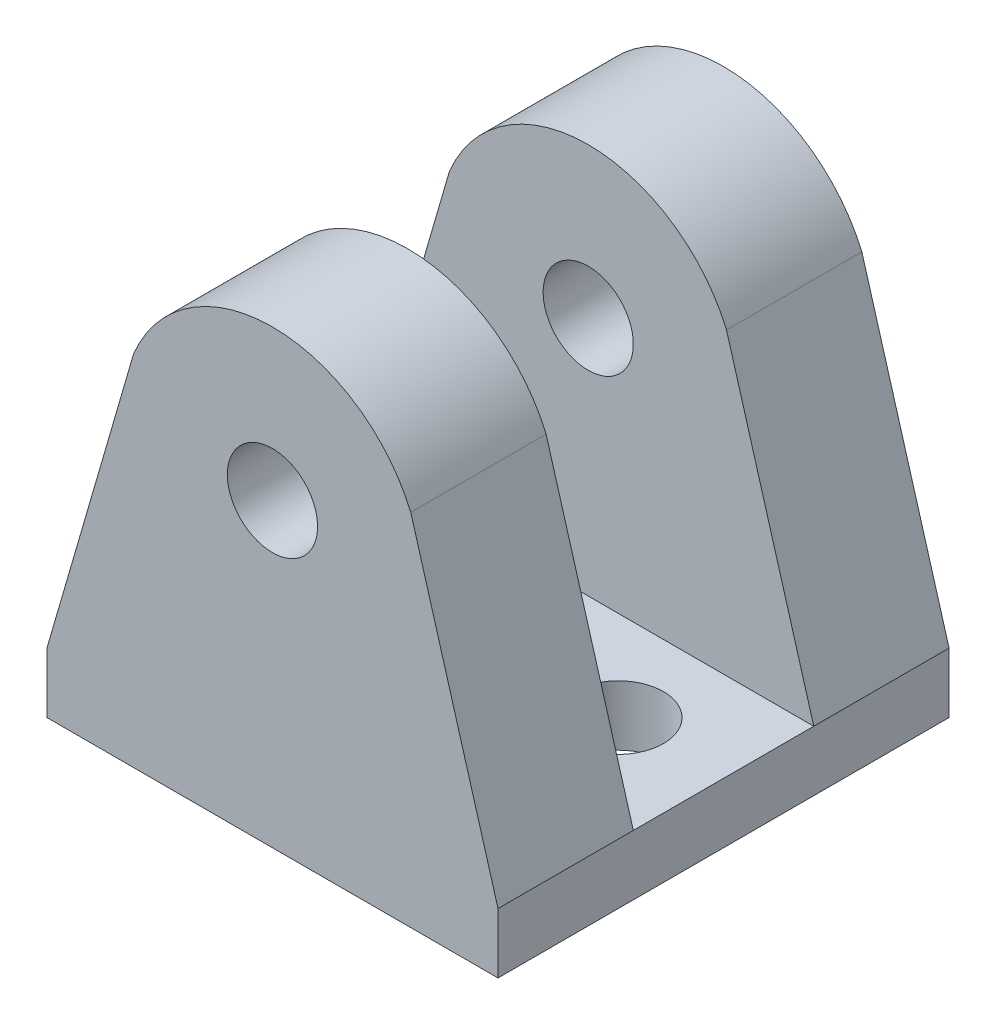
ISO-10303-21;
HEADER;
FILE_DESCRIPTION(('STEP AP214'),'2;1');
FILE_NAME('part.step','',(''),(''),'','','');
FILE_SCHEMA(('AUTOMOTIVE_DESIGN { 1 0 10303 214 1 1 1 1 }'));
ENDSEC;
DATA;
#1=APPLICATION_CONTEXT('core data for automotive mechanical design processes');
#2=APPLICATION_PROTOCOL_DEFINITION('international standard','automotive_design',2000,#1);
#3=PRODUCT_CONTEXT('',#1,'mechanical');
#4=PRODUCT('Part','Part','',(#3));
#5=PRODUCT_RELATED_PRODUCT_CATEGORY('part','',(#4));
#6=PRODUCT_DEFINITION_FORMATION('','',#4);
#7=PRODUCT_DEFINITION_CONTEXT('part definition',#1,'design');
#8=PRODUCT_DEFINITION('design','',#6,#7);
#9=PRODUCT_DEFINITION_SHAPE('','',#8);
#10=(LENGTH_UNIT() NAMED_UNIT(*) SI_UNIT(.MILLI.,.METRE.));
#11=(NAMED_UNIT(*) PLANE_ANGLE_UNIT() SI_UNIT($,.RADIAN.));
#12=(NAMED_UNIT(*) SI_UNIT($,.STERADIAN.) SOLID_ANGLE_UNIT());
#13=UNCERTAINTY_MEASURE_WITH_UNIT(LENGTH_MEASURE(1.E-05),#10,'distance_accuracy_value','');
#14=(GEOMETRIC_REPRESENTATION_CONTEXT(3) GLOBAL_UNCERTAINTY_ASSIGNED_CONTEXT((#13)) GLOBAL_UNIT_ASSIGNED_CONTEXT((#10,
#11,#12)) REPRESENTATION_CONTEXT('',''));
#15=CARTESIAN_POINT('',(0.,0.,0.));
#16=DIRECTION('',(0.,0.,1.));
#17=DIRECTION('',(1.,0.,0.));
#18=AXIS2_PLACEMENT_3D('',#15,#16,#17);
#19=CARTESIAN_POINT('',(7.5,2.,0.));
#20=DIRECTION('',(-1.,0.,0.));
#21=DIRECTION('',(0.,0.,1.));
#22=AXIS2_PLACEMENT_3D('',#19,#20,#21);
#23=PLANE('',#22);
#24=DIRECTION('',(0.,0.,-1.));
#25=VECTOR('',#24,1.);
#26=CARTESIAN_POINT('',(7.5,0.,0.));
#27=LINE('',#26,#25);
#28=CARTESIAN_POINT('',(7.5,0.,15.));
#29=VERTEX_POINT('',#28);
#30=CARTESIAN_POINT('',(7.5,0.,0.));
#31=VERTEX_POINT('',#30);
#32=EDGE_CURVE('E189',#29,#31,#27,.T.);
#33=ORIENTED_EDGE('',*,*,#32,.T.);
#34=DIRECTION('',(0.,-1.,0.));
#35=VECTOR('',#34,1.);
#36=CARTESIAN_POINT('',(7.5,2.,0.));
#37=LINE('',#36,#35);
#38=CARTESIAN_POINT('',(7.5,2.,0.));
#39=VERTEX_POINT('',#38);
#40=EDGE_CURVE('E11',#39,#31,#37,.T.);
#41=ORIENTED_EDGE('',*,*,#40,.F.);
#42=DIRECTION('',(0.,0.,-1.));
#43=VECTOR('',#42,1.);
#44=CARTESIAN_POINT('',(7.5,2.,4.5));
#45=LINE('',#44,#43);
#46=CARTESIAN_POINT('',(7.5,2.,4.5));
#47=VERTEX_POINT('',#46);
#48=EDGE_CURVE('E190',#47,#39,#45,.T.);
#49=ORIENTED_EDGE('',*,*,#48,.F.);
#50=DIRECTION('',(0.,0.,-1.));
#51=VECTOR('',#50,1.);
#52=CARTESIAN_POINT('',(7.5,2.,0.));
#53=LINE('',#52,#51);
#54=CARTESIAN_POINT('',(7.5,2.,10.5));
#55=VERTEX_POINT('',#54);
#56=EDGE_CURVE('E197',#55,#47,#53,.T.);
#57=ORIENTED_EDGE('',*,*,#56,.F.);
#58=CARTESIAN_POINT('',(7.5,2.,15.));
#59=VERTEX_POINT('',#58);
#60=EDGE_CURVE('E193',#59,#55,#53,.T.);
#61=ORIENTED_EDGE('',*,*,#60,.F.);
#62=DIRECTION('',(0.,-1.,0.));
#63=VECTOR('',#62,1.);
#64=CARTESIAN_POINT('',(7.5,2.,15.));
#65=LINE('',#64,#63);
#66=EDGE_CURVE('E155',#59,#29,#65,.T.);
#67=ORIENTED_EDGE('',*,*,#66,.T.);
#68=EDGE_LOOP('',(#33,#41,#49,#57,#61,#67));
#69=FACE_BOUND('',#68,.T.);
#70=ADVANCED_FACE('F33',(#69),#23,.F.);
#71=CARTESIAN_POINT('',(-7.5,2.,0.));
#72=DIRECTION('',(0.,0.,1.));
#73=DIRECTION('',(1.,0.,0.));
#74=AXIS2_PLACEMENT_3D('',#71,#72,#73);
#75=PLANE('',#74);
#76=DIRECTION('',(-1.,0.,0.));
#77=VECTOR('',#76,1.);
#78=CARTESIAN_POINT('',(-7.5,0.,0.));
#79=LINE('',#78,#77);
#80=CARTESIAN_POINT('',(-7.5,0.,0.));
#81=VERTEX_POINT('',#80);
#82=EDGE_CURVE('E54',#31,#81,#79,.T.);
#83=ORIENTED_EDGE('',*,*,#82,.T.);
#84=DIRECTION('',(0.,-1.,0.));
#85=VECTOR('',#84,1.);
#86=CARTESIAN_POINT('',(-7.5,2.,0.));
#87=LINE('',#86,#85);
#88=CARTESIAN_POINT('',(-7.5,2.,0.));
#89=VERTEX_POINT('',#88);
#90=EDGE_CURVE('E40',#89,#81,#87,.T.);
#91=ORIENTED_EDGE('',*,*,#90,.F.);
#92=DIRECTION('',(0.27915208066307,0.960246903593799,0.));
#93=VECTOR('',#92,1.);
#94=CARTESIAN_POINT('',(-4.61502456902073,11.9239408066089,0.));
#95=LINE('',#94,#93);
#96=CARTESIAN_POINT('',(-4.61502456902073,11.9239408066089,0.));
#97=VERTEX_POINT('',#96);
#98=EDGE_CURVE('E172',#89,#97,#95,.T.);
#99=ORIENTED_EDGE('',*,*,#98,.T.);
#100=CARTESIAN_POINT('',(0.,10.,0.));
#101=DIRECTION('',(0.,0.,-1.));
#102=DIRECTION('',(1.,0.,0.));
#103=AXIS2_PLACEMENT_3D('',#100,#101,#102);
#104=CIRCLE('',#103,5.);
#105=CARTESIAN_POINT('',(4.59899134466263,11.9619578516671,0.));
#106=VERTEX_POINT('',#105);
#107=EDGE_CURVE('E165',#97,#106,#104,.T.);
#108=ORIENTED_EDGE('',*,*,#107,.T.);
#109=DIRECTION('',(0.279594733162533,-0.960118110019685,0.));
#110=VECTOR('',#109,1.);
#111=CARTESIAN_POINT('',(4.59899134466263,11.9619578516671,0.));
#112=LINE('',#111,#110);
#113=EDGE_CURVE('E182',#106,#39,#112,.T.);
#114=ORIENTED_EDGE('',*,*,#113,.T.);
#115=ORIENTED_EDGE('',*,*,#40,.T.);
#116=EDGE_LOOP('',(#83,#91,#99,#108,#114,#115));
#117=FACE_BOUND('',#116,.T.);
#118=CARTESIAN_POINT('',(0.,10.,0.));
#119=DIRECTION('',(0.,0.,-1.));
#120=DIRECTION('',(-1.,0.,0.));
#121=AXIS2_PLACEMENT_3D('',#118,#119,#120);
#122=CIRCLE('',#121,1.5);
#123=CARTESIAN_POINT('',(-1.5,10.,0.));
#124=VERTEX_POINT('',#123);
#125=EDGE_CURVE('E161',#124,#124,#122,.T.);
#126=ORIENTED_EDGE('',*,*,#125,.F.);
#127=EDGE_LOOP('',(#126));
#128=FACE_BOUND('',#127,.T.);
#129=ADVANCED_FACE('F230',(#117,#128),#75,.F.);
#130=CARTESIAN_POINT('',(-7.5,2.,7.5));
#131=DIRECTION('',(1.,0.,0.));
#132=DIRECTION('',(0.,0.,-1.));
#133=AXIS2_PLACEMENT_3D('',#130,#131,#132);
#134=PLANE('',#133);
#135=DIRECTION('',(0.,0.,1.));
#136=VECTOR('',#135,1.);
#137=CARTESIAN_POINT('',(-7.5,0.,7.5));
#138=LINE('',#137,#136);
#139=CARTESIAN_POINT('',(-7.5,0.,15.));
#140=VERTEX_POINT('',#139);
#141=EDGE_CURVE('E203',#81,#140,#138,.T.);
#142=ORIENTED_EDGE('',*,*,#141,.T.);
#143=DIRECTION('',(0.,-1.,0.));
#144=VECTOR('',#143,1.);
#145=CARTESIAN_POINT('',(-7.5,2.,15.));
#146=LINE('',#145,#144);
#147=CARTESIAN_POINT('',(-7.5,2.,15.));
#148=VERTEX_POINT('',#147);
#149=EDGE_CURVE('E158',#148,#140,#146,.T.);
#150=ORIENTED_EDGE('',*,*,#149,.F.);
#151=DIRECTION('',(0.,0.,1.));
#152=VECTOR('',#151,1.);
#153=CARTESIAN_POINT('',(-7.5,2.,10.5));
#154=LINE('',#153,#152);
#155=CARTESIAN_POINT('',(-7.5,2.,10.5));
#156=VERTEX_POINT('',#155);
#157=EDGE_CURVE('E131',#156,#148,#154,.T.);
#158=ORIENTED_EDGE('',*,*,#157,.F.);
#159=DIRECTION('',(0.,0.,1.));
#160=VECTOR('',#159,1.);
#161=CARTESIAN_POINT('',(-7.5,2.,7.5));
#162=LINE('',#161,#160);
#163=CARTESIAN_POINT('',(-7.5,2.,4.5));
#164=VERTEX_POINT('',#163);
#165=EDGE_CURVE('E196',#164,#156,#162,.T.);
#166=ORIENTED_EDGE('',*,*,#165,.F.);
#167=EDGE_CURVE('E198',#89,#164,#162,.T.);
#168=ORIENTED_EDGE('',*,*,#167,.F.);
#169=ORIENTED_EDGE('',*,*,#90,.T.);
#170=EDGE_LOOP('',(#142,#150,#158,#166,#168,#169));
#171=FACE_BOUND('',#170,.T.);
#172=ADVANCED_FACE('F207',(#171),#134,.F.);
#173=CARTESIAN_POINT('',(0.,2.,0.));
#174=DIRECTION('',(0.,-1.,0.));
#175=DIRECTION('',(0.,0.,-1.));
#176=AXIS2_PLACEMENT_3D('',#173,#174,#175);
#177=PLANE('',#176);
#178=CARTESIAN_POINT('',(-4.,2.,7.5));
#179=DIRECTION('',(0.,-1.,0.));
#180=DIRECTION('',(0.,0.,1.));
#181=AXIS2_PLACEMENT_3D('',#178,#179,#180);
#182=CIRCLE('',#181,1.5);
#183=CARTESIAN_POINT('',(-4.,2.,9.));
#184=VERTEX_POINT('',#183);
#185=EDGE_CURVE('E265',#184,#184,#182,.T.);
#186=ORIENTED_EDGE('',*,*,#185,.T.);
#187=EDGE_LOOP('',(#186));
#188=FACE_BOUND('',#187,.T.);
#189=CARTESIAN_POINT('',(4.,2.,7.5));
#190=DIRECTION('',(0.,1.,0.));
#191=DIRECTION('',(0.,0.,1.));
#192=AXIS2_PLACEMENT_3D('',#189,#190,#191);
#193=CIRCLE('',#192,1.5);
#194=CARTESIAN_POINT('',(4.,2.,9.));
#195=VERTEX_POINT('',#194);
#196=EDGE_CURVE('E268',#195,#195,#193,.T.);
#197=ORIENTED_EDGE('',*,*,#196,.F.);
#198=EDGE_LOOP('',(#197));
#199=FACE_BOUND('',#198,.T.);
#200=ORIENTED_EDGE('',*,*,#165,.T.);
#201=DIRECTION('',(-1.,0.,0.));
#202=VECTOR('',#201,1.);
#203=CARTESIAN_POINT('',(7.5,2.,10.5));
#204=LINE('',#203,#202);
#205=EDGE_CURVE('E119',#55,#156,#204,.T.);
#206=ORIENTED_EDGE('',*,*,#205,.F.);
#207=ORIENTED_EDGE('',*,*,#56,.T.);
#208=DIRECTION('',(-1.,0.,0.));
#209=VECTOR('',#208,1.);
#210=CARTESIAN_POINT('',(7.5,2.,4.5));
#211=LINE('',#210,#209);
#212=EDGE_CURVE('E175',#47,#164,#211,.T.);
#213=ORIENTED_EDGE('',*,*,#212,.T.);
#214=EDGE_LOOP('',(#200,#206,#207,#213));
#215=FACE_BOUND('',#214,.T.);
#216=ADVANCED_FACE('F219',(#188,#199,#215),#177,.F.);
#217=CARTESIAN_POINT('',(0.,0.,0.));
#218=DIRECTION('',(0.,-1.,0.));
#219=DIRECTION('',(0.,0.,-1.));
#220=AXIS2_PLACEMENT_3D('',#217,#218,#219);
#221=PLANE('',#220);
#222=CARTESIAN_POINT('',(-4.,0.,7.5));
#223=DIRECTION('',(0.,-1.,0.));
#224=DIRECTION('',(0.,0.,1.));
#225=AXIS2_PLACEMENT_3D('',#222,#223,#224);
#226=CIRCLE('',#225,1.5);
#227=CARTESIAN_POINT('',(-4.,0.,9.));
#228=VERTEX_POINT('',#227);
#229=EDGE_CURVE('E271',#228,#228,#226,.T.);
#230=ORIENTED_EDGE('',*,*,#229,.F.);
#231=EDGE_LOOP('',(#230));
#232=FACE_BOUND('',#231,.T.);
#233=CARTESIAN_POINT('',(4.,0.,7.5));
#234=DIRECTION('',(0.,1.,0.));
#235=DIRECTION('',(0.,0.,1.));
#236=AXIS2_PLACEMENT_3D('',#233,#234,#235);
#237=CIRCLE('',#236,1.5);
#238=CARTESIAN_POINT('',(4.,0.,9.));
#239=VERTEX_POINT('',#238);
#240=EDGE_CURVE('E270',#239,#239,#237,.T.);
#241=ORIENTED_EDGE('',*,*,#240,.T.);
#242=EDGE_LOOP('',(#241));
#243=FACE_BOUND('',#242,.T.);
#244=ORIENTED_EDGE('',*,*,#32,.F.);
#245=DIRECTION('',(-1.,0.,0.));
#246=VECTOR('',#245,1.);
#247=CARTESIAN_POINT('',(-7.5,0.,15.));
#248=LINE('',#247,#246);
#249=EDGE_CURVE('E151',#29,#140,#248,.T.);
#250=ORIENTED_EDGE('',*,*,#249,.T.);
#251=ORIENTED_EDGE('',*,*,#141,.F.);
#252=ORIENTED_EDGE('',*,*,#82,.F.);
#253=EDGE_LOOP('',(#244,#250,#251,#252));
#254=FACE_BOUND('',#253,.T.);
#255=ADVANCED_FACE('F211',(#232,#243,#254),#221,.T.);
#256=CARTESIAN_POINT('',(0.,10.,4.5));
#257=DIRECTION('',(0.,0.,-1.));
#258=DIRECTION('',(-1.,0.,0.));
#259=AXIS2_PLACEMENT_3D('',#256,#257,#258);
#260=CYLINDRICAL_SURFACE('',#259,5.);
#261=ORIENTED_EDGE('',*,*,#107,.F.);
#262=DIRECTION('',(0.,0.,-1.));
#263=VECTOR('',#262,1.);
#264=CARTESIAN_POINT('',(-4.61502456902073,11.9239408066089,4.5));
#265=LINE('',#264,#263);
#266=CARTESIAN_POINT('',(-4.61502456902073,11.9239408066089,4.5));
#267=VERTEX_POINT('',#266);
#268=EDGE_CURVE('E187',#267,#97,#265,.T.);
#269=ORIENTED_EDGE('',*,*,#268,.F.);
#270=CARTESIAN_POINT('',(0.,10.,4.5));
#271=DIRECTION('',(0.,0.,-1.));
#272=DIRECTION('',(1.,0.,0.));
#273=AXIS2_PLACEMENT_3D('',#270,#271,#272);
#274=CIRCLE('',#273,5.);
#275=CARTESIAN_POINT('',(4.59899134466263,11.9619578516671,4.5));
#276=VERTEX_POINT('',#275);
#277=EDGE_CURVE('E168',#267,#276,#274,.T.);
#278=ORIENTED_EDGE('',*,*,#277,.T.);
#279=DIRECTION('',(0.,0.,-1.));
#280=VECTOR('',#279,1.);
#281=CARTESIAN_POINT('',(4.59899134466263,11.9619578516671,4.5));
#282=LINE('',#281,#280);
#283=EDGE_CURVE('E179',#276,#106,#282,.T.);
#284=ORIENTED_EDGE('',*,*,#283,.T.);
#285=EDGE_LOOP('',(#261,#269,#278,#284));
#286=FACE_BOUND('',#285,.T.);
#287=ADVANCED_FACE('F234',(#286),#260,.T.);
#288=CARTESIAN_POINT('',(-4.61502456902073,11.9239408066089,4.5));
#289=DIRECTION('',(-0.960246903593799,0.27915208066307,0.));
#290=DIRECTION('',(-0.27915208066307,-0.960246903593799,0.));
#291=AXIS2_PLACEMENT_3D('',#288,#289,#290);
#292=PLANE('',#291);
#293=ORIENTED_EDGE('',*,*,#98,.F.);
#294=ORIENTED_EDGE('',*,*,#167,.T.);
#295=DIRECTION('',(0.27915208066307,0.960246903593799,0.));
#296=VECTOR('',#295,1.);
#297=CARTESIAN_POINT('',(-4.61502456902073,11.9239408066089,4.5));
#298=LINE('',#297,#296);
#299=EDGE_CURVE('E47',#164,#267,#298,.T.);
#300=ORIENTED_EDGE('',*,*,#299,.T.);
#301=ORIENTED_EDGE('',*,*,#268,.T.);
#302=EDGE_LOOP('',(#293,#294,#300,#301));
#303=FACE_BOUND('',#302,.T.);
#304=ADVANCED_FACE('F236',(#303),#292,.T.);
#305=CARTESIAN_POINT('',(4.59899134466263,11.9619578516671,4.5));
#306=DIRECTION('',(0.960118110019685,0.279594733162533,0.));
#307=DIRECTION('',(-0.279594733162533,0.960118110019685,0.));
#308=AXIS2_PLACEMENT_3D('',#305,#306,#307);
#309=PLANE('',#308);
#310=ORIENTED_EDGE('',*,*,#113,.F.);
#311=ORIENTED_EDGE('',*,*,#283,.F.);
#312=DIRECTION('',(0.279594733162533,-0.960118110019685,0.));
#313=VECTOR('',#312,1.);
#314=CARTESIAN_POINT('',(4.59899134466263,11.9619578516671,4.5));
#315=LINE('',#314,#313);
#316=EDGE_CURVE('E171',#276,#47,#315,.T.);
#317=ORIENTED_EDGE('',*,*,#316,.T.);
#318=ORIENTED_EDGE('',*,*,#48,.T.);
#319=EDGE_LOOP('',(#310,#311,#317,#318));
#320=FACE_BOUND('',#319,.T.);
#321=ADVANCED_FACE('F226',(#320),#309,.T.);
#322=CARTESIAN_POINT('',(0.,10.,4.5));
#323=DIRECTION('',(0.,0.,1.));
#324=DIRECTION('',(1.,0.,0.));
#325=AXIS2_PLACEMENT_3D('',#322,#323,#324);
#326=PLANE('',#325);
#327=CARTESIAN_POINT('',(0.,10.,4.5));
#328=DIRECTION('',(0.,0.,-1.));
#329=DIRECTION('',(-1.,0.,0.));
#330=AXIS2_PLACEMENT_3D('',#327,#328,#329);
#331=CIRCLE('',#330,1.5);
#332=CARTESIAN_POINT('',(-1.5,10.,4.5));
#333=VERTEX_POINT('',#332);
#334=EDGE_CURVE('E162',#333,#333,#331,.T.);
#335=ORIENTED_EDGE('',*,*,#334,.T.);
#336=EDGE_LOOP('',(#335));
#337=FACE_BOUND('',#336,.T.);
#338=ORIENTED_EDGE('',*,*,#277,.F.);
#339=ORIENTED_EDGE('',*,*,#299,.F.);
#340=ORIENTED_EDGE('',*,*,#212,.F.);
#341=ORIENTED_EDGE('',*,*,#316,.F.);
#342=EDGE_LOOP('',(#338,#339,#340,#341));
#343=FACE_BOUND('',#342,.T.);
#344=ADVANCED_FACE('F222',(#337,#343),#326,.T.);
#345=CARTESIAN_POINT('',(0.,10.,4.5));
#346=DIRECTION('',(0.,0.,-1.));
#347=DIRECTION('',(-1.,0.,0.));
#348=AXIS2_PLACEMENT_3D('',#345,#346,#347);
#349=CYLINDRICAL_SURFACE('',#348,1.5);
#350=ORIENTED_EDGE('',*,*,#334,.F.);
#351=EDGE_LOOP('',(#350));
#352=FACE_BOUND('',#351,.T.);
#353=ORIENTED_EDGE('',*,*,#125,.T.);
#354=EDGE_LOOP('',(#353));
#355=FACE_BOUND('',#354,.T.);
#356=ADVANCED_FACE('F308',(#352,#355),#349,.F.);
#357=CARTESIAN_POINT('',(-7.5,2.,15.));
#358=DIRECTION('',(0.,0.,1.));
#359=DIRECTION('',(1.,0.,0.));
#360=AXIS2_PLACEMENT_3D('',#357,#358,#359);
#361=PLANE('',#360);
#362=ORIENTED_EDGE('',*,*,#249,.F.);
#363=ORIENTED_EDGE('',*,*,#66,.F.);
#364=DIRECTION('',(0.279594733162533,-0.960118110019685,0.));
#365=VECTOR('',#364,1.);
#366=CARTESIAN_POINT('',(4.59899134466264,11.9619578516671,15.));
#367=LINE('',#366,#365);
#368=CARTESIAN_POINT('',(4.59899134466264,11.9619578516671,15.));
#369=VERTEX_POINT('',#368);
#370=EDGE_CURVE('E137',#369,#59,#367,.T.);
#371=ORIENTED_EDGE('',*,*,#370,.F.);
#372=CARTESIAN_POINT('',(0.,10.,15.));
#373=DIRECTION('',(0.,0.,-1.));
#374=DIRECTION('',(1.,0.,0.));
#375=AXIS2_PLACEMENT_3D('',#372,#373,#374);
#376=CIRCLE('',#375,5.);
#377=CARTESIAN_POINT('',(-4.61502456902072,11.9239408066089,15.));
#378=VERTEX_POINT('',#377);
#379=EDGE_CURVE('E146',#378,#369,#376,.T.);
#380=ORIENTED_EDGE('',*,*,#379,.F.);
#381=DIRECTION('',(0.27915208066307,0.960246903593799,0.));
#382=VECTOR('',#381,1.);
#383=CARTESIAN_POINT('',(-4.61502456902072,11.9239408066089,15.));
#384=LINE('',#383,#382);
#385=EDGE_CURVE('E127',#148,#378,#384,.T.);
#386=ORIENTED_EDGE('',*,*,#385,.F.);
#387=ORIENTED_EDGE('',*,*,#149,.T.);
#388=EDGE_LOOP('',(#362,#363,#371,#380,#386,#387));
#389=FACE_BOUND('',#388,.T.);
#390=CARTESIAN_POINT('',(0.,10.,15.));
#391=DIRECTION('',(0.,0.,-1.));
#392=DIRECTION('',(-1.,0.,0.));
#393=AXIS2_PLACEMENT_3D('',#390,#391,#392);
#394=CIRCLE('',#393,1.5);
#395=CARTESIAN_POINT('',(-1.5,10.,15.));
#396=VERTEX_POINT('',#395);
#397=EDGE_CURVE('E141',#396,#396,#394,.T.);
#398=ORIENTED_EDGE('',*,*,#397,.T.);
#399=EDGE_LOOP('',(#398));
#400=FACE_BOUND('',#399,.T.);
#401=ADVANCED_FACE('F215',(#389,#400),#361,.T.);
#402=CARTESIAN_POINT('',(0.,10.,10.5));
#403=DIRECTION('',(0.,0.,-1.));
#404=DIRECTION('',(1.,0.,0.));
#405=AXIS2_PLACEMENT_3D('',#402,#403,#404);
#406=PLANE('',#405);
#407=CARTESIAN_POINT('',(0.,10.,10.5));
#408=DIRECTION('',(0.,0.,-1.));
#409=DIRECTION('',(1.,0.,0.));
#410=AXIS2_PLACEMENT_3D('',#407,#408,#409);
#411=CIRCLE('',#410,5.);
#412=CARTESIAN_POINT('',(-4.61502456902073,11.9239408066089,10.5));
#413=VERTEX_POINT('',#412);
#414=CARTESIAN_POINT('',(4.59899134466264,11.9619578516671,10.5));
#415=VERTEX_POINT('',#414);
#416=EDGE_CURVE('E116',#413,#415,#411,.T.);
#417=ORIENTED_EDGE('',*,*,#416,.T.);
#418=DIRECTION('',(0.279594733162533,-0.960118110019685,0.));
#419=VECTOR('',#418,1.);
#420=CARTESIAN_POINT('',(4.59899134466264,11.9619578516671,10.5));
#421=LINE('',#420,#419);
#422=EDGE_CURVE('E132',#415,#55,#421,.T.);
#423=ORIENTED_EDGE('',*,*,#422,.T.);
#424=ORIENTED_EDGE('',*,*,#205,.T.);
#425=DIRECTION('',(0.27915208066307,0.960246903593799,0.));
#426=VECTOR('',#425,1.);
#427=CARTESIAN_POINT('',(-4.61502456902073,11.9239408066089,10.5));
#428=LINE('',#427,#426);
#429=EDGE_CURVE('E111',#156,#413,#428,.T.);
#430=ORIENTED_EDGE('',*,*,#429,.T.);
#431=EDGE_LOOP('',(#417,#423,#424,#430));
#432=FACE_BOUND('',#431,.T.);
#433=CARTESIAN_POINT('',(0.,10.,10.5));
#434=DIRECTION('',(0.,0.,-1.));
#435=DIRECTION('',(-1.,0.,0.));
#436=AXIS2_PLACEMENT_3D('',#433,#434,#435);
#437=CIRCLE('',#436,1.5);
#438=CARTESIAN_POINT('',(-1.5,10.,10.5));
#439=VERTEX_POINT('',#438);
#440=EDGE_CURVE('E148',#439,#439,#437,.T.);
#441=ORIENTED_EDGE('',*,*,#440,.F.);
#442=EDGE_LOOP('',(#441));
#443=FACE_BOUND('',#442,.T.);
#444=ADVANCED_FACE('F113',(#432,#443),#406,.T.);
#445=CARTESIAN_POINT('',(0.,10.,10.5));
#446=DIRECTION('',(0.,0.,1.));
#447=DIRECTION('',(1.,0.,0.));
#448=AXIS2_PLACEMENT_3D('',#445,#446,#447);
#449=CYLINDRICAL_SURFACE('',#448,5.);
#450=ORIENTED_EDGE('',*,*,#379,.T.);
#451=DIRECTION('',(0.,0.,1.));
#452=VECTOR('',#451,1.);
#453=CARTESIAN_POINT('',(4.59899134466264,11.9619578516671,10.5));
#454=LINE('',#453,#452);
#455=EDGE_CURVE('E136',#415,#369,#454,.T.);
#456=ORIENTED_EDGE('',*,*,#455,.F.);
#457=ORIENTED_EDGE('',*,*,#416,.F.);
#458=DIRECTION('',(0.,0.,1.));
#459=VECTOR('',#458,1.);
#460=CARTESIAN_POINT('',(-4.61502456902073,11.9239408066089,10.5));
#461=LINE('',#460,#459);
#462=EDGE_CURVE('E125',#413,#378,#461,.T.);
#463=ORIENTED_EDGE('',*,*,#462,.T.);
#464=EDGE_LOOP('',(#450,#456,#457,#463));
#465=FACE_BOUND('',#464,.T.);
#466=ADVANCED_FACE('F134',(#465),#449,.T.);
#467=CARTESIAN_POINT('',(4.59899134466264,11.9619578516671,10.5));
#468=DIRECTION('',(-0.960118110019685,-0.279594733162533,0.));
#469=DIRECTION('',(0.279594733162533,-0.960118110019685,0.));
#470=AXIS2_PLACEMENT_3D('',#467,#468,#469);
#471=PLANE('',#470);
#472=ORIENTED_EDGE('',*,*,#370,.T.);
#473=ORIENTED_EDGE('',*,*,#60,.T.);
#474=ORIENTED_EDGE('',*,*,#422,.F.);
#475=ORIENTED_EDGE('',*,*,#455,.T.);
#476=EDGE_LOOP('',(#472,#473,#474,#475));
#477=FACE_BOUND('',#476,.T.);
#478=ADVANCED_FACE('F295',(#477),#471,.F.);
#479=CARTESIAN_POINT('',(-4.61502456902073,11.9239408066089,10.5));
#480=DIRECTION('',(0.960246903593799,-0.27915208066307,0.));
#481=DIRECTION('',(0.27915208066307,0.960246903593799,0.));
#482=AXIS2_PLACEMENT_3D('',#479,#480,#481);
#483=PLANE('',#482);
#484=ORIENTED_EDGE('',*,*,#385,.T.);
#485=ORIENTED_EDGE('',*,*,#462,.F.);
#486=ORIENTED_EDGE('',*,*,#429,.F.);
#487=ORIENTED_EDGE('',*,*,#157,.T.);
#488=EDGE_LOOP('',(#484,#485,#486,#487));
#489=FACE_BOUND('',#488,.T.);
#490=ADVANCED_FACE('F126',(#489),#483,.F.);
#491=CARTESIAN_POINT('',(0.,10.,10.5));
#492=DIRECTION('',(0.,0.,1.));
#493=DIRECTION('',(1.,0.,0.));
#494=AXIS2_PLACEMENT_3D('',#491,#492,#493);
#495=CYLINDRICAL_SURFACE('',#494,1.5);
#496=ORIENTED_EDGE('',*,*,#440,.T.);
#497=EDGE_LOOP('',(#496));
#498=FACE_BOUND('',#497,.T.);
#499=ORIENTED_EDGE('',*,*,#397,.F.);
#500=EDGE_LOOP('',(#499));
#501=FACE_BOUND('',#500,.T.);
#502=ADVANCED_FACE('F284',(#498,#501),#495,.F.);
#503=CARTESIAN_POINT('',(4.,0.,7.5));
#504=DIRECTION('',(0.,1.,0.));
#505=DIRECTION('',(0.,0.,1.));
#506=AXIS2_PLACEMENT_3D('',#503,#504,#505);
#507=CYLINDRICAL_SURFACE('',#506,1.5);
#508=ORIENTED_EDGE('',*,*,#240,.F.);
#509=EDGE_LOOP('',(#508));
#510=FACE_BOUND('',#509,.T.);
#511=ORIENTED_EDGE('',*,*,#196,.T.);
#512=EDGE_LOOP('',(#511));
#513=FACE_BOUND('',#512,.T.);
#514=ADVANCED_FACE('F286',(#510,#513),#507,.F.);
#515=CARTESIAN_POINT('',(-4.,0.,7.5));
#516=DIRECTION('',(0.,1.,0.));
#517=DIRECTION('',(0.,0.,1.));
#518=AXIS2_PLACEMENT_3D('',#515,#516,#517);
#519=CYLINDRICAL_SURFACE('',#518,1.5);
#520=ORIENTED_EDGE('',*,*,#229,.T.);
#521=EDGE_LOOP('',(#520));
#522=FACE_BOUND('',#521,.T.);
#523=ORIENTED_EDGE('',*,*,#185,.F.);
#524=EDGE_LOOP('',(#523));
#525=FACE_BOUND('',#524,.T.);
#526=ADVANCED_FACE('F292',(#522,#525),#519,.F.);
#527=CLOSED_SHELL('',(#70,#129,#172,#216,#255,#287,#304,#321,#344,#356,#401,#444,#466,#478,#490,
#502,#514,#526));
#528=MANIFOLD_SOLID_BREP('B2',#527);
#529=ADVANCED_BREP_SHAPE_REPRESENTATION('',(#18,#528),#14);
#530=SHAPE_DEFINITION_REPRESENTATION(#9,#529);
ENDSEC;
END-ISO-10303-21;
